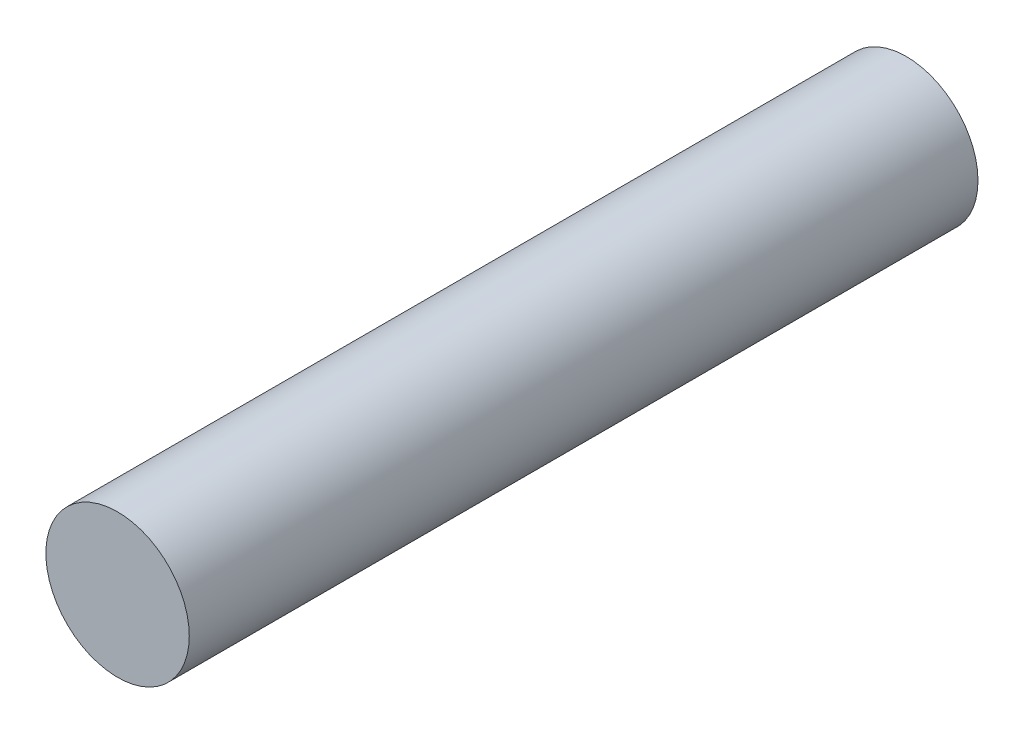
ISO-10303-21;
HEADER;
FILE_DESCRIPTION(('STEP AP214'),'2;1');
FILE_NAME('part.step','',(''),(''),'','','');
FILE_SCHEMA(('AUTOMOTIVE_DESIGN { 1 0 10303 214 1 1 1 1 }'));
ENDSEC;
DATA;
#1=APPLICATION_CONTEXT('core data for automotive mechanical design processes');
#2=APPLICATION_PROTOCOL_DEFINITION('international standard','automotive_design',2000,#1);
#3=PRODUCT_CONTEXT('',#1,'mechanical');
#4=PRODUCT('Part','Part','',(#3));
#5=PRODUCT_RELATED_PRODUCT_CATEGORY('part','',(#4));
#6=PRODUCT_DEFINITION_FORMATION('','',#4);
#7=PRODUCT_DEFINITION_CONTEXT('part definition',#1,'design');
#8=PRODUCT_DEFINITION('design','',#6,#7);
#9=PRODUCT_DEFINITION_SHAPE('','',#8);
#10=(LENGTH_UNIT() NAMED_UNIT(*) SI_UNIT(.MILLI.,.METRE.));
#11=(NAMED_UNIT(*) PLANE_ANGLE_UNIT() SI_UNIT($,.RADIAN.));
#12=(NAMED_UNIT(*) SI_UNIT($,.STERADIAN.) SOLID_ANGLE_UNIT());
#13=UNCERTAINTY_MEASURE_WITH_UNIT(LENGTH_MEASURE(1.E-05),#10,'distance_accuracy_value','');
#14=(GEOMETRIC_REPRESENTATION_CONTEXT(3) GLOBAL_UNCERTAINTY_ASSIGNED_CONTEXT((#13)) GLOBAL_UNIT_ASSIGNED_CONTEXT((#10,
#11,#12)) REPRESENTATION_CONTEXT('',''));
#15=CARTESIAN_POINT('',(0.,0.,0.));
#16=DIRECTION('',(0.,0.,1.));
#17=DIRECTION('',(1.,0.,0.));
#18=AXIS2_PLACEMENT_3D('',#15,#16,#17);
#19=CARTESIAN_POINT('',(0.,0.,34.925));
#20=DIRECTION('',(0.,0.,-1.));
#21=DIRECTION('',(-1.,0.,0.));
#22=AXIS2_PLACEMENT_3D('',#19,#20,#21);
#23=CYLINDRICAL_SURFACE('',#22,3.175);
#24=CARTESIAN_POINT('',(0.,0.,34.925));
#25=DIRECTION('',(0.,0.,1.));
#26=DIRECTION('',(1.,0.,0.));
#27=AXIS2_PLACEMENT_3D('',#24,#25,#26);
#28=CIRCLE('',#27,3.175);
#29=CARTESIAN_POINT('',(3.175,0.,34.925));
#30=VERTEX_POINT('',#29);
#31=EDGE_CURVE('E10',#30,#30,#28,.T.);
#32=ORIENTED_EDGE('',*,*,#31,.F.);
#33=EDGE_LOOP('',(#32));
#34=FACE_BOUND('',#33,.T.);
#35=CARTESIAN_POINT('',(0.,0.,0.));
#36=DIRECTION('',(0.,0.,1.));
#37=DIRECTION('',(1.,0.,0.));
#38=AXIS2_PLACEMENT_3D('',#35,#36,#37);
#39=CIRCLE('',#38,3.175);
#40=CARTESIAN_POINT('',(3.175,0.,0.));
#41=VERTEX_POINT('',#40);
#42=EDGE_CURVE('E36',#41,#41,#39,.T.);
#43=ORIENTED_EDGE('',*,*,#42,.T.);
#44=EDGE_LOOP('',(#43));
#45=FACE_BOUND('',#44,.T.);
#46=ADVANCED_FACE('F33',(#34,#45),#23,.T.);
#47=CARTESIAN_POINT('',(0.,0.,34.925));
#48=DIRECTION('',(0.,0.,1.));
#49=DIRECTION('',(1.,0.,0.));
#50=AXIS2_PLACEMENT_3D('',#47,#48,#49);
#51=PLANE('',#50);
#52=ORIENTED_EDGE('',*,*,#31,.T.);
#53=EDGE_LOOP('',(#52));
#54=FACE_BOUND('',#53,.T.);
#55=ADVANCED_FACE('F48',(#54),#51,.T.);
#56=CARTESIAN_POINT('',(0.,0.,0.));
#57=DIRECTION('',(0.,0.,1.));
#58=DIRECTION('',(1.,0.,0.));
#59=AXIS2_PLACEMENT_3D('',#56,#57,#58);
#60=PLANE('',#59);
#61=ORIENTED_EDGE('',*,*,#42,.F.);
#62=EDGE_LOOP('',(#61));
#63=FACE_BOUND('',#62,.T.);
#64=ADVANCED_FACE('F46',(#63),#60,.F.);
#65=CLOSED_SHELL('',(#46,#55,#64));
#66=MANIFOLD_SOLID_BREP('B2',#65);
#67=ADVANCED_BREP_SHAPE_REPRESENTATION('',(#18,#66),#14);
#68=SHAPE_DEFINITION_REPRESENTATION(#9,#67);
ENDSEC;
END-ISO-10303-21;
